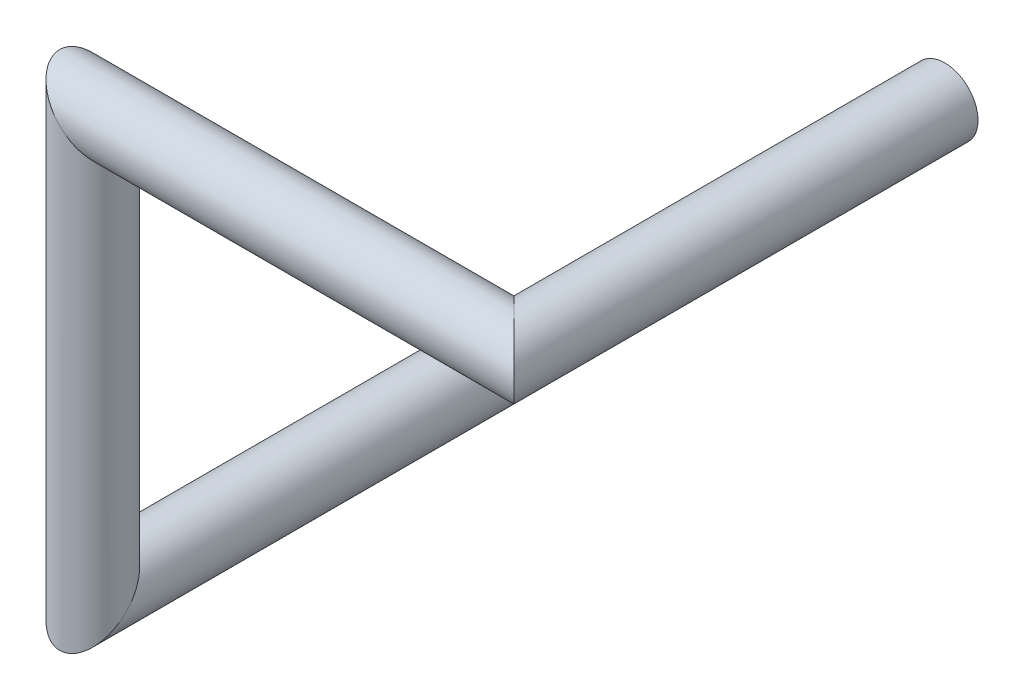
ISO-10303-21;
HEADER;
FILE_DESCRIPTION(('STEP AP214'),'2;1');
FILE_NAME('part.step','',(''),(''),'','','');
FILE_SCHEMA(('AUTOMOTIVE_DESIGN { 1 0 10303 214 1 1 1 1 }'));
ENDSEC;
DATA;
#1=APPLICATION_CONTEXT('core data for automotive mechanical design processes');
#2=APPLICATION_PROTOCOL_DEFINITION('international standard','automotive_design',2000,#1);
#3=PRODUCT_CONTEXT('',#1,'mechanical');
#4=PRODUCT('Part','Part','',(#3));
#5=PRODUCT_RELATED_PRODUCT_CATEGORY('part','',(#4));
#6=PRODUCT_DEFINITION_FORMATION('','',#4);
#7=PRODUCT_DEFINITION_CONTEXT('part definition',#1,'design');
#8=PRODUCT_DEFINITION('design','',#6,#7);
#9=PRODUCT_DEFINITION_SHAPE('','',#8);
#10=(LENGTH_UNIT() NAMED_UNIT(*) SI_UNIT(.MILLI.,.METRE.));
#11=(NAMED_UNIT(*) PLANE_ANGLE_UNIT() SI_UNIT($,.RADIAN.));
#12=(NAMED_UNIT(*) SI_UNIT($,.STERADIAN.) SOLID_ANGLE_UNIT());
#13=UNCERTAINTY_MEASURE_WITH_UNIT(LENGTH_MEASURE(1.E-05),#10,'distance_accuracy_value','');
#14=(GEOMETRIC_REPRESENTATION_CONTEXT(3) GLOBAL_UNCERTAINTY_ASSIGNED_CONTEXT((#13)) GLOBAL_UNIT_ASSIGNED_CONTEXT((#10,
#11,#12)) REPRESENTATION_CONTEXT('',''));
#15=CARTESIAN_POINT('',(0.,0.,0.));
#16=DIRECTION('',(0.,0.,1.));
#17=DIRECTION('',(1.,0.,0.));
#18=AXIS2_PLACEMENT_3D('',#15,#16,#17);
#19=CARTESIAN_POINT('',(2.54,2.54,0.));
#20=DIRECTION('',(0.,0.,1.));
#21=DIRECTION('',(1.,0.,0.));
#22=AXIS2_PLACEMENT_3D('',#19,#20,#21);
#23=PLANE('',#22);
#24=CARTESIAN_POINT('',(2.54,2.54,0.));
#25=DIRECTION('',(0.,0.,1.));
#26=DIRECTION('',(1.,0.,0.));
#27=AXIS2_PLACEMENT_3D('',#24,#25,#26);
#28=CIRCLE('',#27,0.2);
#29=CARTESIAN_POINT('',(2.74,2.54,0.));
#30=VERTEX_POINT('',#29);
#31=EDGE_CURVE('E58',#30,#30,#28,.T.);
#32=ORIENTED_EDGE('',*,*,#31,.F.);
#33=EDGE_LOOP('',(#32));
#34=FACE_BOUND('',#33,.T.);
#35=ADVANCED_FACE('F55',(#34),#23,.F.);
#36=CARTESIAN_POINT('',(0.,0.,0.));
#37=DIRECTION('',(0.,0.,-1.));
#38=DIRECTION('',(0.,-1.,0.));
#39=AXIS2_PLACEMENT_3D('',#36,#37,#38);
#40=PLANE('',#39);
#41=CARTESIAN_POINT('',(0.,0.,0.));
#42=DIRECTION('',(0.,0.,-1.));
#43=DIRECTION('',(0.,-1.,0.));
#44=AXIS2_PLACEMENT_3D('',#41,#42,#43);
#45=CIRCLE('',#44,0.2);
#46=CARTESIAN_POINT('',(0.,-0.2,0.));
#47=VERTEX_POINT('',#46);
#48=EDGE_CURVE('E63',#47,#47,#45,.T.);
#49=ORIENTED_EDGE('',*,*,#48,.T.);
#50=EDGE_LOOP('',(#49));
#51=FACE_BOUND('',#50,.T.);
#52=ADVANCED_FACE('F86',(#51),#40,.T.);
#53=CARTESIAN_POINT('',(2.54,2.54,2.92));
#54=DIRECTION('',(0.,0.,-1.));
#55=DIRECTION('',(-1.,0.,0.));
#56=AXIS2_PLACEMENT_3D('',#53,#54,#55);
#57=CYLINDRICAL_SURFACE('',#56,0.2);
#58=CARTESIAN_POINT('',(2.54,2.54,2.6));
#59=DIRECTION('',(0.707106781186548,0.,-0.707106781186548));
#60=DIRECTION('',(0.707106781186548,0.,0.707106781186548));
#61=AXIS2_PLACEMENT_3D('',#58,#59,#60);
#62=ELLIPSE('',#61,0.282842712474619,0.2);
#63=CARTESIAN_POINT('',(2.74,2.54,2.8));
#64=VERTEX_POINT('',#63);
#65=EDGE_CURVE('E74',#64,#64,#62,.T.);
#66=ORIENTED_EDGE('',*,*,#65,.T.);
#67=EDGE_LOOP('',(#66));
#68=FACE_BOUND('',#67,.T.);
#69=ORIENTED_EDGE('',*,*,#31,.T.);
#70=EDGE_LOOP('',(#69));
#71=FACE_BOUND('',#70,.T.);
#72=ADVANCED_FACE('F83',(#68,#71),#57,.T.);
#73=CARTESIAN_POINT('',(-0.54,2.54,2.6));
#74=DIRECTION('',(1.,0.,0.));
#75=DIRECTION('',(0.,0.,-1.));
#76=AXIS2_PLACEMENT_3D('',#73,#74,#75);
#77=CYLINDRICAL_SURFACE('',#76,0.2);
#78=CARTESIAN_POINT('',(0.,2.54,2.6));
#79=DIRECTION('',(0.707106781186548,0.707106781186548,0.));
#80=DIRECTION('',(-0.707106781186548,0.707106781186548,0.));
#81=AXIS2_PLACEMENT_3D('',#78,#79,#80);
#82=ELLIPSE('',#81,0.282842712474619,0.2);
#83=CARTESIAN_POINT('',(-0.2,2.74,2.6));
#84=VERTEX_POINT('',#83);
#85=EDGE_CURVE('E69',#84,#84,#82,.T.);
#86=ORIENTED_EDGE('',*,*,#85,.T.);
#87=EDGE_LOOP('',(#86));
#88=FACE_BOUND('',#87,.T.);
#89=ORIENTED_EDGE('',*,*,#65,.F.);
#90=EDGE_LOOP('',(#89));
#91=FACE_BOUND('',#90,.T.);
#92=ADVANCED_FACE('F99',(#88,#91),#77,.T.);
#93=CARTESIAN_POINT('',(0.,-0.32,2.6));
#94=DIRECTION('',(0.,1.,0.));
#95=DIRECTION('',(-1.,0.,0.));
#96=AXIS2_PLACEMENT_3D('',#93,#94,#95);
#97=CYLINDRICAL_SURFACE('',#96,0.2);
#98=CARTESIAN_POINT('',(0.,0.,2.6));
#99=DIRECTION('',(0.,0.707106781186548,0.707106781186548));
#100=DIRECTION('',(0.,-0.707106781186548,0.707106781186548));
#101=AXIS2_PLACEMENT_3D('',#98,#99,#100);
#102=ELLIPSE('',#101,0.282842712474619,0.2);
#103=CARTESIAN_POINT('',(0.,-0.2,2.8));
#104=VERTEX_POINT('',#103);
#105=EDGE_CURVE('E11',#104,#104,#102,.T.);
#106=ORIENTED_EDGE('',*,*,#105,.T.);
#107=EDGE_LOOP('',(#106));
#108=FACE_BOUND('',#107,.T.);
#109=ORIENTED_EDGE('',*,*,#85,.F.);
#110=EDGE_LOOP('',(#109));
#111=FACE_BOUND('',#110,.T.);
#112=ADVANCED_FACE('F93',(#108,#111),#97,.T.);
#113=CARTESIAN_POINT('',(0.,0.,0.));
#114=DIRECTION('',(0.,0.,1.));
#115=DIRECTION('',(1.,0.,0.));
#116=AXIS2_PLACEMENT_3D('',#113,#114,#115);
#117=CYLINDRICAL_SURFACE('',#116,0.2);
#118=ORIENTED_EDGE('',*,*,#48,.F.);
#119=EDGE_LOOP('',(#118));
#120=FACE_BOUND('',#119,.T.);
#121=ORIENTED_EDGE('',*,*,#105,.F.);
#122=EDGE_LOOP('',(#121));
#123=FACE_BOUND('',#122,.T.);
#124=ADVANCED_FACE('F91',(#120,#123),#117,.T.);
#125=CLOSED_SHELL('',(#35,#52,#72,#92,#112,#124));
#126=MANIFOLD_SOLID_BREP('B2',#125);
#127=ADVANCED_BREP_SHAPE_REPRESENTATION('',(#18,#126),#14);
#128=SHAPE_DEFINITION_REPRESENTATION(#9,#127);
ENDSEC;
END-ISO-10303-21;
